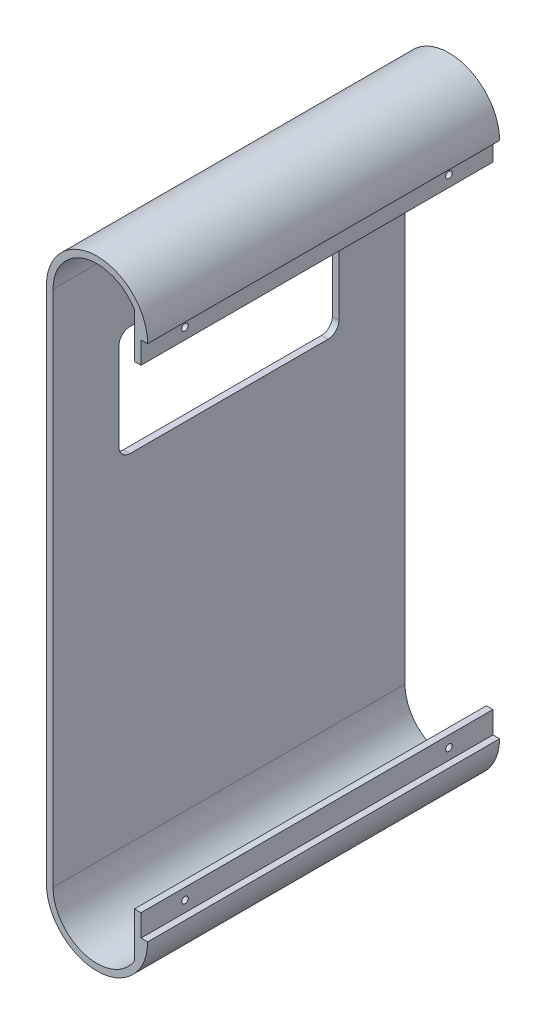
ISO-10303-21;
HEADER;
FILE_DESCRIPTION(('STEP AP214'),'2;1');
FILE_NAME('part.step','',(''),(''),'','','');
FILE_SCHEMA(('AUTOMOTIVE_DESIGN { 1 0 10303 214 1 1 1 1 }'));
ENDSEC;
DATA;
#1=APPLICATION_CONTEXT('core data for automotive mechanical design processes');
#2=APPLICATION_PROTOCOL_DEFINITION('international standard','automotive_design',2000,#1);
#3=PRODUCT_CONTEXT('',#1,'mechanical');
#4=PRODUCT('Part','Part','',(#3));
#5=PRODUCT_RELATED_PRODUCT_CATEGORY('part','',(#4));
#6=PRODUCT_DEFINITION_FORMATION('','',#4);
#7=PRODUCT_DEFINITION_CONTEXT('part definition',#1,'design');
#8=PRODUCT_DEFINITION('design','',#6,#7);
#9=PRODUCT_DEFINITION_SHAPE('','',#8);
#10=(LENGTH_UNIT() NAMED_UNIT(*) SI_UNIT(.MILLI.,.METRE.));
#11=(NAMED_UNIT(*) PLANE_ANGLE_UNIT() SI_UNIT($,.RADIAN.));
#12=(NAMED_UNIT(*) SI_UNIT($,.STERADIAN.) SOLID_ANGLE_UNIT());
#13=UNCERTAINTY_MEASURE_WITH_UNIT(LENGTH_MEASURE(1.E-05),#10,'distance_accuracy_value','');
#14=(GEOMETRIC_REPRESENTATION_CONTEXT(3) GLOBAL_UNCERTAINTY_ASSIGNED_CONTEXT((#13)) GLOBAL_UNIT_ASSIGNED_CONTEXT((#10,
#11,#12)) REPRESENTATION_CONTEXT('',''));
#15=CARTESIAN_POINT('',(0.,0.,0.));
#16=DIRECTION('',(0.,0.,1.));
#17=DIRECTION('',(1.,0.,0.));
#18=AXIS2_PLACEMENT_3D('',#15,#16,#17);
#19=CARTESIAN_POINT('',(4.,60.2499999999995,-160.000000000005));
#20=DIRECTION('',(0.,0.,-1.));
#21=DIRECTION('',(0.,-1.,0.));
#22=AXIS2_PLACEMENT_3D('',#19,#20,#21);
#23=PLANE('',#22);
#24=DIRECTION('',(1.,0.,0.));
#25=VECTOR('',#24,1.);
#26=CARTESIAN_POINT('',(0.,160.5,-160.000000000007));
#27=LINE('',#26,#25);
#28=CARTESIAN_POINT('',(0.,160.5,-160.000000000007));
#29=VERTEX_POINT('',#28);
#30=CARTESIAN_POINT('',(3.,160.5,-160.000000000007));
#31=VERTEX_POINT('',#30);
#32=EDGE_CURVE('E344',#29,#31,#27,.T.);
#33=ORIENTED_EDGE('',*,*,#32,.F.);
#34=DIRECTION('',(0.,-1.,0.));
#35=VECTOR('',#34,1.);
#36=CARTESIAN_POINT('',(-1.91556839834739E-12,150.500000000001,-160.000000000007));
#37=LINE('',#36,#35);
#38=CARTESIAN_POINT('',(-1.91556839834739E-12,150.500000000001,-160.000000000007));
#39=VERTEX_POINT('',#38);
#40=EDGE_CURVE('E261',#29,#39,#37,.T.);
#41=ORIENTED_EDGE('',*,*,#40,.T.);
#42=DIRECTION('',(-1.,0.,0.));
#43=VECTOR('',#42,1.);
#44=CARTESIAN_POINT('',(-3.00000000000191,150.500000000001,-160.000000000007));
#45=LINE('',#44,#43);
#46=CARTESIAN_POINT('',(-3.00000000000191,150.500000000001,-160.000000000007));
#47=VERTEX_POINT('',#46);
#48=EDGE_CURVE('E260',#39,#47,#45,.T.);
#49=ORIENTED_EDGE('',*,*,#48,.T.);
#50=DIRECTION('',(0.,1.,0.));
#51=VECTOR('',#50,1.);
#52=CARTESIAN_POINT('',(-3.00000000000191,150.500000000001,-160.000000000007));
#53=LINE('',#52,#51);
#54=CARTESIAN_POINT('',(-3.00000000000229,171.035653752857,-160.000000000007));
#55=VERTEX_POINT('',#54);
#56=EDGE_CURVE('E264',#47,#55,#53,.T.);
#57=ORIENTED_EDGE('',*,*,#56,.T.);
#58=CARTESIAN_POINT('',(-20.,160.5,-160.000000000007));
#59=DIRECTION('',(0.,0.,-1.));
#60=DIRECTION('',(0.,1.,0.));
#61=AXIS2_PLACEMENT_3D('',#58,#59,#60);
#62=CIRCLE('',#61,20.);
#63=CARTESIAN_POINT('',(-40.,160.5,-160.000000000005));
#64=VERTEX_POINT('',#63);
#65=EDGE_CURVE('E348',#64,#55,#62,.T.);
#66=ORIENTED_EDGE('',*,*,#65,.F.);
#67=DIRECTION('',(0.,1.,0.));
#68=VECTOR('',#67,1.);
#69=CARTESIAN_POINT('',(-40.,-74.9999999999967,-160.000000000004));
#70=LINE('',#69,#68);
#71=CARTESIAN_POINT('',(-40.,-75.,-160.000000000004));
#72=VERTEX_POINT('',#71);
#73=EDGE_CURVE('E306',#72,#64,#70,.T.);
#74=ORIENTED_EDGE('',*,*,#73,.F.);
#75=CARTESIAN_POINT('',(-20.,-75.,-160.000000000004));
#76=DIRECTION('',(0.,0.,-1.));
#77=DIRECTION('',(0.,1.,0.));
#78=AXIS2_PLACEMENT_3D('',#75,#76,#77);
#79=CIRCLE('',#78,20.);
#80=CARTESIAN_POINT('',(-3.,-85.5356537528528,-160.000000000004));
#81=VERTEX_POINT('',#80);
#82=EDGE_CURVE('E327',#81,#72,#79,.T.);
#83=ORIENTED_EDGE('',*,*,#82,.F.);
#84=DIRECTION('',(0.,1.,0.));
#85=VECTOR('',#84,1.);
#86=CARTESIAN_POINT('',(-3.,-65.,-160.000000000004));
#87=LINE('',#86,#85);
#88=CARTESIAN_POINT('',(-3.,-65.,-160.000000000004));
#89=VERTEX_POINT('',#88);
#90=EDGE_CURVE('E281',#81,#89,#87,.T.);
#91=ORIENTED_EDGE('',*,*,#90,.T.);
#92=DIRECTION('',(1.,0.,0.));
#93=VECTOR('',#92,1.);
#94=CARTESIAN_POINT('',(-3.,-65.,-160.000000000004));
#95=LINE('',#94,#93);
#96=CARTESIAN_POINT('',(0.,-65.,-160.000000000004));
#97=VERTEX_POINT('',#96);
#98=EDGE_CURVE('E286',#89,#97,#95,.T.);
#99=ORIENTED_EDGE('',*,*,#98,.T.);
#100=DIRECTION('',(0.,-1.,0.));
#101=VECTOR('',#100,1.);
#102=CARTESIAN_POINT('',(0.,-65.,-160.000000000004));
#103=LINE('',#102,#101);
#104=CARTESIAN_POINT('',(0.,-75.,-160.000000000004));
#105=VERTEX_POINT('',#104);
#106=EDGE_CURVE('E282',#97,#105,#103,.T.);
#107=ORIENTED_EDGE('',*,*,#106,.T.);
#108=DIRECTION('',(-1.,0.,0.));
#109=VECTOR('',#108,1.);
#110=CARTESIAN_POINT('',(0.,-75.,-160.000000000004));
#111=LINE('',#110,#109);
#112=CARTESIAN_POINT('',(3.,-75.,-160.000000000004));
#113=VERTEX_POINT('',#112);
#114=EDGE_CURVE('E331',#113,#105,#111,.T.);
#115=ORIENTED_EDGE('',*,*,#114,.F.);
#116=CARTESIAN_POINT('',(-20.,-75.,-160.000000000004));
#117=DIRECTION('',(0.,0.,-1.));
#118=DIRECTION('',(0.,1.,0.));
#119=AXIS2_PLACEMENT_3D('',#116,#117,#118);
#120=CIRCLE('',#119,23.);
#121=CARTESIAN_POINT('',(-43.,-75.,-160.000000000004));
#122=VERTEX_POINT('',#121);
#123=EDGE_CURVE('E334',#122,#113,#120,.F.);
#124=ORIENTED_EDGE('',*,*,#123,.F.);
#125=DIRECTION('',(0.,-1.,0.));
#126=VECTOR('',#125,1.);
#127=CARTESIAN_POINT('',(-43.,-74.9999999999967,-160.000000000004));
#128=LINE('',#127,#126);
#129=CARTESIAN_POINT('',(-43.,160.5,-160.000000000007));
#130=VERTEX_POINT('',#129);
#131=EDGE_CURVE('E337',#130,#122,#128,.T.);
#132=ORIENTED_EDGE('',*,*,#131,.F.);
#133=CARTESIAN_POINT('',(-20.,160.5,-160.000000000007));
#134=DIRECTION('',(0.,0.,-1.));
#135=DIRECTION('',(0.,1.,0.));
#136=AXIS2_PLACEMENT_3D('',#133,#134,#135);
#137=CIRCLE('',#136,23.);
#138=EDGE_CURVE('E341',#31,#130,#137,.F.);
#139=ORIENTED_EDGE('',*,*,#138,.F.);
#140=EDGE_LOOP('',(#33,#41,#49,#57,#66,#74,#83,#91,#99,#107,#115,#124,#132,#139));
#141=FACE_BOUND('',#140,.T.);
#142=ADVANCED_FACE('F34',(#141),#23,.T.);
#143=CARTESIAN_POINT('',(-20.,-75.,0.));
#144=DIRECTION('',(0.,0.,1.));
#145=DIRECTION('',(1.,0.,0.));
#146=AXIS2_PLACEMENT_3D('',#143,#144,#145);
#147=PLANE('',#146);
#148=CARTESIAN_POINT('',(-20.,160.5,0.));
#149=DIRECTION('',(0.,0.,-1.));
#150=DIRECTION('',(-1.,0.,0.));
#151=AXIS2_PLACEMENT_3D('',#148,#149,#150);
#152=CIRCLE('',#151,20.);
#153=CARTESIAN_POINT('',(-40.,160.5,0.));
#154=VERTEX_POINT('',#153);
#155=CARTESIAN_POINT('',(-3.00000000000229,171.035653752857,0.));
#156=VERTEX_POINT('',#155);
#157=EDGE_CURVE('E317',#154,#156,#152,.T.);
#158=ORIENTED_EDGE('',*,*,#157,.T.);
#159=DIRECTION('',(0.,1.,0.));
#160=VECTOR('',#159,1.);
#161=CARTESIAN_POINT('',(-3.00000000000191,150.500000000003,0.));
#162=LINE('',#161,#160);
#163=CARTESIAN_POINT('',(-3.00000000000191,150.500000000001,0.));
#164=VERTEX_POINT('',#163);
#165=EDGE_CURVE('E263',#164,#156,#162,.T.);
#166=ORIENTED_EDGE('',*,*,#165,.F.);
#167=DIRECTION('',(-1.,0.,0.));
#168=VECTOR('',#167,1.);
#169=CARTESIAN_POINT('',(-3.00000000000191,150.500000000003,0.));
#170=LINE('',#169,#168);
#171=CARTESIAN_POINT('',(-1.91556839834736E-12,150.500000000001,0.));
#172=VERTEX_POINT('',#171);
#173=EDGE_CURVE('E272',#172,#164,#170,.T.);
#174=ORIENTED_EDGE('',*,*,#173,.F.);
#175=DIRECTION('',(0.,-1.,0.));
#176=VECTOR('',#175,1.);
#177=CARTESIAN_POINT('',(-1.91556839834739E-12,150.500000000003,0.));
#178=LINE('',#177,#176);
#179=CARTESIAN_POINT('',(-2.09730250691962E-12,160.5,0.));
#180=VERTEX_POINT('',#179);
#181=EDGE_CURVE('E271',#180,#172,#178,.T.);
#182=ORIENTED_EDGE('',*,*,#181,.F.);
#183=DIRECTION('',(1.,0.,0.));
#184=VECTOR('',#183,1.);
#185=CARTESIAN_POINT('',(0.,160.5,0.));
#186=LINE('',#185,#184);
#187=CARTESIAN_POINT('',(3.,160.5,0.));
#188=VERTEX_POINT('',#187);
#189=EDGE_CURVE('E314',#180,#188,#186,.T.);
#190=ORIENTED_EDGE('',*,*,#189,.T.);
#191=CARTESIAN_POINT('',(-20.,160.5,0.));
#192=DIRECTION('',(0.,0.,1.));
#193=DIRECTION('',(-1.,0.,0.));
#194=AXIS2_PLACEMENT_3D('',#191,#192,#193);
#195=CIRCLE('',#194,23.);
#196=CARTESIAN_POINT('',(-43.,160.5,0.));
#197=VERTEX_POINT('',#196);
#198=EDGE_CURVE('E312',#188,#197,#195,.T.);
#199=ORIENTED_EDGE('',*,*,#198,.T.);
#200=DIRECTION('',(0.,-1.,0.));
#201=VECTOR('',#200,1.);
#202=CARTESIAN_POINT('',(-43.,-75.,0.));
#203=LINE('',#202,#201);
#204=CARTESIAN_POINT('',(-43.,-75.,0.));
#205=VERTEX_POINT('',#204);
#206=EDGE_CURVE('E309',#197,#205,#203,.T.);
#207=ORIENTED_EDGE('',*,*,#206,.T.);
#208=CARTESIAN_POINT('',(-20.,-75.,0.));
#209=DIRECTION('',(0.,0.,1.));
#210=DIRECTION('',(1.,0.,0.));
#211=AXIS2_PLACEMENT_3D('',#208,#209,#210);
#212=CIRCLE('',#211,23.);
#213=CARTESIAN_POINT('',(3.,-75.,0.));
#214=VERTEX_POINT('',#213);
#215=EDGE_CURVE('E307',#205,#214,#212,.T.);
#216=ORIENTED_EDGE('',*,*,#215,.T.);
#217=DIRECTION('',(-1.,0.,0.));
#218=VECTOR('',#217,1.);
#219=CARTESIAN_POINT('',(0.,-75.,0.));
#220=LINE('',#219,#218);
#221=CARTESIAN_POINT('',(0.,-75.,0.));
#222=VERTEX_POINT('',#221);
#223=EDGE_CURVE('E303',#214,#222,#220,.T.);
#224=ORIENTED_EDGE('',*,*,#223,.T.);
#225=DIRECTION('',(0.,-1.,0.));
#226=VECTOR('',#225,1.);
#227=CARTESIAN_POINT('',(0.,-64.9999999999979,0.));
#228=LINE('',#227,#226);
#229=CARTESIAN_POINT('',(0.,-64.9999999999982,0.));
#230=VERTEX_POINT('',#229);
#231=EDGE_CURVE('E296',#230,#222,#228,.T.);
#232=ORIENTED_EDGE('',*,*,#231,.F.);
#233=DIRECTION('',(1.,0.,0.));
#234=VECTOR('',#233,1.);
#235=CARTESIAN_POINT('',(-3.,-64.9999999999982,0.));
#236=LINE('',#235,#234);
#237=CARTESIAN_POINT('',(-3.,-64.9999999999982,0.));
#238=VERTEX_POINT('',#237);
#239=EDGE_CURVE('E285',#238,#230,#236,.T.);
#240=ORIENTED_EDGE('',*,*,#239,.F.);
#241=DIRECTION('',(0.,1.,0.));
#242=VECTOR('',#241,1.);
#243=CARTESIAN_POINT('',(-3.,-64.9999999999979,0.));
#244=LINE('',#243,#242);
#245=CARTESIAN_POINT('',(-3.,-85.5356537528528,0.));
#246=VERTEX_POINT('',#245);
#247=EDGE_CURVE('E293',#246,#238,#244,.T.);
#248=ORIENTED_EDGE('',*,*,#247,.F.);
#249=CARTESIAN_POINT('',(-20.,-75.,0.));
#250=DIRECTION('',(0.,0.,-1.));
#251=DIRECTION('',(1.,0.,0.));
#252=AXIS2_PLACEMENT_3D('',#249,#250,#251);
#253=CIRCLE('',#252,20.);
#254=CARTESIAN_POINT('',(-40.,-75.,0.));
#255=VERTEX_POINT('',#254);
#256=EDGE_CURVE('E302',#246,#255,#253,.T.);
#257=ORIENTED_EDGE('',*,*,#256,.T.);
#258=DIRECTION('',(0.,1.,0.));
#259=VECTOR('',#258,1.);
#260=CARTESIAN_POINT('',(-40.,-75.,0.));
#261=LINE('',#260,#259);
#262=EDGE_CURVE('E320',#255,#154,#261,.T.);
#263=ORIENTED_EDGE('',*,*,#262,.T.);
#264=EDGE_LOOP('',(#158,#166,#174,#182,#190,#199,#207,#216,#224,#232,#240,#248,#257,#263));
#265=FACE_BOUND('',#264,.T.);
#266=ADVANCED_FACE('F391',(#265),#147,.T.);
#267=CARTESIAN_POINT('',(-40.,-75.,-445.233676132401));
#268=DIRECTION('',(1.,0.,0.));
#269=DIRECTION('',(0.,0.,-1.));
#270=AXIS2_PLACEMENT_3D('',#267,#268,#269);
#271=PLANE('',#270);
#272=DIRECTION('',(0.,-1.,0.));
#273=VECTOR('',#272,1.);
#274=CARTESIAN_POINT('',(-40.,123.257283518407,-130.00000000001));
#275=LINE('',#274,#273);
#276=CARTESIAN_POINT('',(-40.,123.257283518407,-130.00000000001));
#277=VERTEX_POINT('',#276);
#278=CARTESIAN_POINT('',(-40.,83.2572835184067,-130.00000000001));
#279=VERTEX_POINT('',#278);
#280=EDGE_CURVE('E198',#277,#279,#275,.T.);
#281=ORIENTED_EDGE('',*,*,#280,.T.);
#282=CARTESIAN_POINT('',(-40.,83.2572835184067,-125.00000000001));
#283=DIRECTION('',(1.,0.,0.));
#284=DIRECTION('',(0.,0.,-1.));
#285=AXIS2_PLACEMENT_3D('',#282,#283,#284);
#286=CIRCLE('',#285,5.);
#287=CARTESIAN_POINT('',(-40.,78.2572835184067,-125.00000000001));
#288=VERTEX_POINT('',#287);
#289=EDGE_CURVE('E185',#279,#288,#286,.F.);
#290=ORIENTED_EDGE('',*,*,#289,.T.);
#291=DIRECTION('',(0.,0.,1.));
#292=VECTOR('',#291,1.);
#293=CARTESIAN_POINT('',(-40.,78.2572835184067,-125.00000000001));
#294=LINE('',#293,#292);
#295=CARTESIAN_POINT('',(-40.,78.2572835184067,-35.0000000000102));
#296=VERTEX_POINT('',#295);
#297=EDGE_CURVE('E232',#288,#296,#294,.T.);
#298=ORIENTED_EDGE('',*,*,#297,.T.);
#299=CARTESIAN_POINT('',(-40.,83.2572835184067,-35.0000000000102));
#300=DIRECTION('',(1.,0.,0.));
#301=DIRECTION('',(0.,0.,-1.));
#302=AXIS2_PLACEMENT_3D('',#299,#300,#301);
#303=CIRCLE('',#302,5.);
#304=CARTESIAN_POINT('',(-40.,83.2572835184067,-30.0000000000102));
#305=VERTEX_POINT('',#304);
#306=EDGE_CURVE('E228',#296,#305,#303,.F.);
#307=ORIENTED_EDGE('',*,*,#306,.T.);
#308=DIRECTION('',(0.,1.,0.));
#309=VECTOR('',#308,1.);
#310=CARTESIAN_POINT('',(-40.,123.257283518407,-30.0000000000102));
#311=LINE('',#310,#309);
#312=CARTESIAN_POINT('',(-40.,123.257283518407,-30.0000000000102));
#313=VERTEX_POINT('',#312);
#314=EDGE_CURVE('E224',#305,#313,#311,.T.);
#315=ORIENTED_EDGE('',*,*,#314,.T.);
#316=CARTESIAN_POINT('',(-40.,123.257283518407,-35.0000000000102));
#317=DIRECTION('',(1.,0.,0.));
#318=DIRECTION('',(0.,0.,-1.));
#319=AXIS2_PLACEMENT_3D('',#316,#317,#318);
#320=CIRCLE('',#319,5.);
#321=CARTESIAN_POINT('',(-40.,128.257283518407,-35.0000000000102));
#322=VERTEX_POINT('',#321);
#323=EDGE_CURVE('E220',#313,#322,#320,.F.);
#324=ORIENTED_EDGE('',*,*,#323,.T.);
#325=DIRECTION('',(0.,0.,-1.));
#326=VECTOR('',#325,1.);
#327=CARTESIAN_POINT('',(-40.,128.257283518407,-125.00000000001));
#328=LINE('',#327,#326);
#329=CARTESIAN_POINT('',(-40.,128.257283518407,-125.00000000001));
#330=VERTEX_POINT('',#329);
#331=EDGE_CURVE('E217',#322,#330,#328,.T.);
#332=ORIENTED_EDGE('',*,*,#331,.T.);
#333=CARTESIAN_POINT('',(-40.,123.257283518407,-125.00000000001));
#334=DIRECTION('',(1.,0.,0.));
#335=DIRECTION('',(0.,0.,-1.));
#336=AXIS2_PLACEMENT_3D('',#333,#334,#335);
#337=CIRCLE('',#336,5.);
#338=EDGE_CURVE('E207',#330,#277,#337,.F.);
#339=ORIENTED_EDGE('',*,*,#338,.T.);
#340=EDGE_LOOP('',(#281,#290,#298,#307,#315,#324,#332,#339));
#341=FACE_BOUND('',#340,.T.);
#342=DIRECTION('',(0.,0.,1.));
#343=VECTOR('',#342,1.);
#344=CARTESIAN_POINT('',(-40.,-75.,-445.233676132401));
#345=LINE('',#344,#343);
#346=EDGE_CURVE('E329',#72,#255,#345,.T.);
#347=ORIENTED_EDGE('',*,*,#346,.F.);
#348=ORIENTED_EDGE('',*,*,#73,.T.);
#349=DIRECTION('',(0.,0.,1.));
#350=VECTOR('',#349,1.);
#351=CARTESIAN_POINT('',(-40.,160.5,-445.233676132401));
#352=LINE('',#351,#350);
#353=EDGE_CURVE('E326',#64,#154,#352,.T.);
#354=ORIENTED_EDGE('',*,*,#353,.T.);
#355=ORIENTED_EDGE('',*,*,#262,.F.);
#356=EDGE_LOOP('',(#347,#348,#354,#355));
#357=FACE_BOUND('',#356,.T.);
#358=ADVANCED_FACE('F204',(#341,#357),#271,.T.);
#359=CARTESIAN_POINT('',(-20.,160.5,-445.233676132401));
#360=DIRECTION('',(0.,0.,1.));
#361=DIRECTION('',(1.,0.,0.));
#362=AXIS2_PLACEMENT_3D('',#359,#360,#361);
#363=CYLINDRICAL_SURFACE('',#362,20.);
#364=DIRECTION('',(0.,0.,1.));
#365=VECTOR('',#364,1.);
#366=CARTESIAN_POINT('',(-3.00000000000229,171.035653752857,-445.233676132401));
#367=LINE('',#366,#365);
#368=EDGE_CURVE('E11',#156,#55,#367,.F.);
#369=ORIENTED_EDGE('',*,*,#368,.F.);
#370=ORIENTED_EDGE('',*,*,#157,.F.);
#371=ORIENTED_EDGE('',*,*,#353,.F.);
#372=ORIENTED_EDGE('',*,*,#65,.T.);
#373=EDGE_LOOP('',(#369,#370,#371,#372));
#374=FACE_BOUND('',#373,.T.);
#375=ADVANCED_FACE('F403',(#374),#363,.F.);
#376=CARTESIAN_POINT('',(0.,160.5,-445.233676132401));
#377=DIRECTION('',(0.,-1.,0.));
#378=DIRECTION('',(0.,0.,-1.));
#379=AXIS2_PLACEMENT_3D('',#376,#377,#378);
#380=PLANE('',#379);
#381=DIRECTION('',(0.,0.,1.));
#382=VECTOR('',#381,1.);
#383=CARTESIAN_POINT('',(0.,160.5,-445.233676132401));
#384=LINE('',#383,#382);
#385=EDGE_CURVE('E347',#29,#180,#384,.T.);
#386=ORIENTED_EDGE('',*,*,#385,.F.);
#387=ORIENTED_EDGE('',*,*,#32,.T.);
#388=DIRECTION('',(0.,0.,1.));
#389=VECTOR('',#388,1.);
#390=CARTESIAN_POINT('',(3.,160.5,-445.233676132401));
#391=LINE('',#390,#389);
#392=EDGE_CURVE('E343',#31,#188,#391,.T.);
#393=ORIENTED_EDGE('',*,*,#392,.T.);
#394=ORIENTED_EDGE('',*,*,#189,.F.);
#395=EDGE_LOOP('',(#386,#387,#393,#394));
#396=FACE_BOUND('',#395,.T.);
#397=ADVANCED_FACE('F388',(#396),#380,.T.);
#398=CARTESIAN_POINT('',(-20.,160.5,-445.233676132401));
#399=DIRECTION('',(0.,0.,1.));
#400=DIRECTION('',(1.,0.,0.));
#401=AXIS2_PLACEMENT_3D('',#398,#399,#400);
#402=CYLINDRICAL_SURFACE('',#401,23.);
#403=ORIENTED_EDGE('',*,*,#138,.T.);
#404=DIRECTION('',(0.,0.,1.));
#405=VECTOR('',#404,1.);
#406=CARTESIAN_POINT('',(-43.,160.5,-445.233676132401));
#407=LINE('',#406,#405);
#408=EDGE_CURVE('E340',#130,#197,#407,.T.);
#409=ORIENTED_EDGE('',*,*,#408,.T.);
#410=ORIENTED_EDGE('',*,*,#198,.F.);
#411=ORIENTED_EDGE('',*,*,#392,.F.);
#412=EDGE_LOOP('',(#403,#409,#410,#411));
#413=FACE_BOUND('',#412,.T.);
#414=ADVANCED_FACE('F435',(#413),#402,.T.);
#415=CARTESIAN_POINT('',(-43.,-75.,-445.233676132401));
#416=DIRECTION('',(-1.,0.,0.));
#417=DIRECTION('',(0.,-1.,0.));
#418=AXIS2_PLACEMENT_3D('',#415,#416,#417);
#419=PLANE('',#418);
#420=DIRECTION('',(0.,-1.,0.));
#421=VECTOR('',#420,1.);
#422=CARTESIAN_POINT('',(-43.,123.257283518407,-130.00000000001));
#423=LINE('',#422,#421);
#424=CARTESIAN_POINT('',(-43.,123.257283518407,-130.00000000001));
#425=VERTEX_POINT('',#424);
#426=CARTESIAN_POINT('',(-43.,83.2572835184067,-130.00000000001));
#427=VERTEX_POINT('',#426);
#428=EDGE_CURVE('E201',#425,#427,#423,.T.);
#429=ORIENTED_EDGE('',*,*,#428,.F.);
#430=CARTESIAN_POINT('',(-43.,123.257283518407,-125.00000000001));
#431=DIRECTION('',(-1.,0.,0.));
#432=DIRECTION('',(0.,-1.,0.));
#433=AXIS2_PLACEMENT_3D('',#430,#431,#432);
#434=CIRCLE('',#433,5.);
#435=CARTESIAN_POINT('',(-43.,128.257283518407,-125.00000000001));
#436=VERTEX_POINT('',#435);
#437=EDGE_CURVE('E213',#436,#425,#434,.T.);
#438=ORIENTED_EDGE('',*,*,#437,.F.);
#439=DIRECTION('',(0.,0.,-1.));
#440=VECTOR('',#439,1.);
#441=CARTESIAN_POINT('',(-43.,128.257283518407,-125.00000000001));
#442=LINE('',#441,#440);
#443=CARTESIAN_POINT('',(-43.,128.257283518407,-35.0000000000102));
#444=VERTEX_POINT('',#443);
#445=EDGE_CURVE('E58',#444,#436,#442,.T.);
#446=ORIENTED_EDGE('',*,*,#445,.F.);
#447=CARTESIAN_POINT('',(-43.,123.257283518407,-35.0000000000102));
#448=DIRECTION('',(-1.,0.,0.));
#449=DIRECTION('',(0.,1.,0.));
#450=AXIS2_PLACEMENT_3D('',#447,#448,#449);
#451=CIRCLE('',#450,5.);
#452=CARTESIAN_POINT('',(-43.,123.257283518407,-30.0000000000102));
#453=VERTEX_POINT('',#452);
#454=EDGE_CURVE('E209',#453,#444,#451,.T.);
#455=ORIENTED_EDGE('',*,*,#454,.F.);
#456=DIRECTION('',(0.,1.,0.));
#457=VECTOR('',#456,1.);
#458=CARTESIAN_POINT('',(-43.,123.257283518407,-30.0000000000102));
#459=LINE('',#458,#457);
#460=CARTESIAN_POINT('',(-43.,83.2572835184067,-30.0000000000102));
#461=VERTEX_POINT('',#460);
#462=EDGE_CURVE('E698',#461,#453,#459,.T.);
#463=ORIENTED_EDGE('',*,*,#462,.F.);
#464=CARTESIAN_POINT('',(-43.,83.2572835184067,-35.0000000000102));
#465=DIRECTION('',(-1.,0.,0.));
#466=DIRECTION('',(0.,-1.,0.));
#467=AXIS2_PLACEMENT_3D('',#464,#465,#466);
#468=CIRCLE('',#467,5.);
#469=CARTESIAN_POINT('',(-43.,78.2572835184067,-35.0000000000102));
#470=VERTEX_POINT('',#469);
#471=EDGE_CURVE('E695',#470,#461,#468,.T.);
#472=ORIENTED_EDGE('',*,*,#471,.F.);
#473=DIRECTION('',(0.,0.,1.));
#474=VECTOR('',#473,1.);
#475=CARTESIAN_POINT('',(-43.,78.2572835184067,-125.00000000001));
#476=LINE('',#475,#474);
#477=CARTESIAN_POINT('',(-43.,78.2572835184067,-125.00000000001));
#478=VERTEX_POINT('',#477);
#479=EDGE_CURVE('E690',#478,#470,#476,.T.);
#480=ORIENTED_EDGE('',*,*,#479,.F.);
#481=CARTESIAN_POINT('',(-43.,83.2572835184067,-125.00000000001));
#482=DIRECTION('',(-1.,0.,0.));
#483=DIRECTION('',(0.,-1.,0.));
#484=AXIS2_PLACEMENT_3D('',#481,#482,#483);
#485=CIRCLE('',#484,5.);
#486=EDGE_CURVE('E689',#427,#478,#485,.T.);
#487=ORIENTED_EDGE('',*,*,#486,.F.);
#488=EDGE_LOOP('',(#429,#438,#446,#455,#463,#472,#480,#487));
#489=FACE_BOUND('',#488,.T.);
#490=ORIENTED_EDGE('',*,*,#408,.F.);
#491=ORIENTED_EDGE('',*,*,#131,.T.);
#492=DIRECTION('',(0.,0.,1.));
#493=VECTOR('',#492,1.);
#494=CARTESIAN_POINT('',(-43.,-75.,-445.233676132401));
#495=LINE('',#494,#493);
#496=EDGE_CURVE('E336',#122,#205,#495,.T.);
#497=ORIENTED_EDGE('',*,*,#496,.T.);
#498=ORIENTED_EDGE('',*,*,#206,.F.);
#499=EDGE_LOOP('',(#490,#491,#497,#498));
#500=FACE_BOUND('',#499,.T.);
#501=ADVANCED_FACE('F433',(#489,#500),#419,.T.);
#502=CARTESIAN_POINT('',(-20.,-75.,-445.233676132401));
#503=DIRECTION('',(0.,0.,1.));
#504=DIRECTION('',(1.,0.,0.));
#505=AXIS2_PLACEMENT_3D('',#502,#503,#504);
#506=CYLINDRICAL_SURFACE('',#505,23.);
#507=ORIENTED_EDGE('',*,*,#123,.T.);
#508=DIRECTION('',(0.,0.,1.));
#509=VECTOR('',#508,1.);
#510=CARTESIAN_POINT('',(3.,-75.,-445.233676132401));
#511=LINE('',#510,#509);
#512=EDGE_CURVE('E333',#113,#214,#511,.T.);
#513=ORIENTED_EDGE('',*,*,#512,.T.);
#514=ORIENTED_EDGE('',*,*,#215,.F.);
#515=ORIENTED_EDGE('',*,*,#496,.F.);
#516=EDGE_LOOP('',(#507,#513,#514,#515));
#517=FACE_BOUND('',#516,.T.);
#518=ADVANCED_FACE('F430',(#517),#506,.T.);
#519=CARTESIAN_POINT('',(0.,-75.,-445.233676132401));
#520=DIRECTION('',(0.,1.,0.));
#521=DIRECTION('',(0.,0.,1.));
#522=AXIS2_PLACEMENT_3D('',#519,#520,#521);
#523=PLANE('',#522);
#524=ORIENTED_EDGE('',*,*,#512,.F.);
#525=ORIENTED_EDGE('',*,*,#114,.T.);
#526=DIRECTION('',(0.,0.,1.));
#527=VECTOR('',#526,1.);
#528=CARTESIAN_POINT('',(0.,-75.,-445.233676132401));
#529=LINE('',#528,#527);
#530=EDGE_CURVE('E330',#105,#222,#529,.T.);
#531=ORIENTED_EDGE('',*,*,#530,.T.);
#532=ORIENTED_EDGE('',*,*,#223,.F.);
#533=EDGE_LOOP('',(#524,#525,#531,#532));
#534=FACE_BOUND('',#533,.T.);
#535=ADVANCED_FACE('F425',(#534),#523,.T.);
#536=CARTESIAN_POINT('',(-20.,-75.,-445.233676132401));
#537=DIRECTION('',(0.,0.,1.));
#538=DIRECTION('',(1.,0.,0.));
#539=AXIS2_PLACEMENT_3D('',#536,#537,#538);
#540=CYLINDRICAL_SURFACE('',#539,20.);
#541=DIRECTION('',(0.,0.,1.));
#542=VECTOR('',#541,1.);
#543=CARTESIAN_POINT('',(-3.,-85.5356537528528,-445.233676132401));
#544=LINE('',#543,#542);
#545=EDGE_CURVE('E42',#81,#246,#544,.T.);
#546=ORIENTED_EDGE('',*,*,#545,.F.);
#547=ORIENTED_EDGE('',*,*,#82,.T.);
#548=ORIENTED_EDGE('',*,*,#346,.T.);
#549=ORIENTED_EDGE('',*,*,#256,.F.);
#550=EDGE_LOOP('',(#546,#547,#548,#549));
#551=FACE_BOUND('',#550,.T.);
#552=ADVANCED_FACE('F406',(#551),#540,.F.);
#553=CARTESIAN_POINT('',(0.,-64.9999999999979,21.5674832521582));
#554=DIRECTION('',(1.,0.,0.));
#555=DIRECTION('',(0.,1.,0.));
#556=AXIS2_PLACEMENT_3D('',#553,#554,#555);
#557=PLANE('',#556);
#558=CARTESIAN_POINT('',(0.,-69.9999999999982,-20.));
#559=DIRECTION('',(1.,0.,0.));
#560=DIRECTION('',(0.,1.,0.));
#561=AXIS2_PLACEMENT_3D('',#558,#559,#560);
#562=CIRCLE('',#561,1.5);
#563=CARTESIAN_POINT('',(0.,-68.4999999999982,-20.));
#564=VERTEX_POINT('',#563);
#565=EDGE_CURVE('E257',#564,#564,#562,.T.);
#566=ORIENTED_EDGE('',*,*,#565,.F.);
#567=EDGE_LOOP('',(#566));
#568=FACE_BOUND('',#567,.T.);
#569=CARTESIAN_POINT('',(0.,-69.9999999999982,-140.000000000007));
#570=DIRECTION('',(1.,0.,0.));
#571=DIRECTION('',(0.,1.,0.));
#572=AXIS2_PLACEMENT_3D('',#569,#570,#571);
#573=CIRCLE('',#572,1.5);
#574=CARTESIAN_POINT('',(0.,-68.4999999999982,-140.000000000007));
#575=VERTEX_POINT('',#574);
#576=EDGE_CURVE('E254',#575,#575,#573,.T.);
#577=ORIENTED_EDGE('',*,*,#576,.F.);
#578=EDGE_LOOP('',(#577));
#579=FACE_BOUND('',#578,.T.);
#580=ORIENTED_EDGE('',*,*,#530,.F.);
#581=ORIENTED_EDGE('',*,*,#106,.F.);
#582=DIRECTION('',(0.,0.,-1.));
#583=VECTOR('',#582,1.);
#584=CARTESIAN_POINT('',(0.,-64.9999999999979,21.5674832521582));
#585=LINE('',#584,#583);
#586=EDGE_CURVE('E292',#230,#97,#585,.T.);
#587=ORIENTED_EDGE('',*,*,#586,.F.);
#588=ORIENTED_EDGE('',*,*,#231,.T.);
#589=EDGE_LOOP('',(#580,#581,#587,#588));
#590=FACE_BOUND('',#589,.T.);
#591=ADVANCED_FACE('F422',(#568,#579,#590),#557,.T.);
#592=CARTESIAN_POINT('',(-3.,-64.9999999999979,21.5674832521582));
#593=DIRECTION('',(0.,1.,0.));
#594=DIRECTION('',(0.,0.,1.));
#595=AXIS2_PLACEMENT_3D('',#592,#593,#594);
#596=PLANE('',#595);
#597=DIRECTION('',(0.,0.,-1.));
#598=VECTOR('',#597,1.);
#599=CARTESIAN_POINT('',(-3.,-64.9999999999979,21.5674832521582));
#600=LINE('',#599,#598);
#601=EDGE_CURVE('E295',#238,#89,#600,.T.);
#602=ORIENTED_EDGE('',*,*,#601,.F.);
#603=ORIENTED_EDGE('',*,*,#239,.T.);
#604=ORIENTED_EDGE('',*,*,#586,.T.);
#605=ORIENTED_EDGE('',*,*,#98,.F.);
#606=EDGE_LOOP('',(#602,#603,#604,#605));
#607=FACE_BOUND('',#606,.T.);
#608=ADVANCED_FACE('F415',(#607),#596,.T.);
#609=CARTESIAN_POINT('',(-3.,-64.9999999999979,21.5674832521582));
#610=DIRECTION('',(-1.,0.,0.));
#611=DIRECTION('',(0.,-1.,0.));
#612=AXIS2_PLACEMENT_3D('',#609,#610,#611);
#613=PLANE('',#612);
#614=CARTESIAN_POINT('',(-3.,-69.9999999999982,-20.));
#615=DIRECTION('',(-1.,0.,0.));
#616=DIRECTION('',(0.,-1.,0.));
#617=AXIS2_PLACEMENT_3D('',#614,#615,#616);
#618=CIRCLE('',#617,1.5);
#619=CARTESIAN_POINT('',(-3.,-71.4999999999982,-20.));
#620=VERTEX_POINT('',#619);
#621=EDGE_CURVE('E242',#620,#620,#618,.T.);
#622=ORIENTED_EDGE('',*,*,#621,.F.);
#623=EDGE_LOOP('',(#622));
#624=FACE_BOUND('',#623,.T.);
#625=CARTESIAN_POINT('',(-3.,-69.9999999999982,-140.000000000007));
#626=DIRECTION('',(-1.,0.,0.));
#627=DIRECTION('',(0.,-1.,0.));
#628=AXIS2_PLACEMENT_3D('',#625,#626,#627);
#629=CIRCLE('',#628,1.5);
#630=CARTESIAN_POINT('',(-3.,-71.4999999999982,-140.000000000007));
#631=VERTEX_POINT('',#630);
#632=EDGE_CURVE('E245',#631,#631,#629,.T.);
#633=ORIENTED_EDGE('',*,*,#632,.F.);
#634=EDGE_LOOP('',(#633));
#635=FACE_BOUND('',#634,.T.);
#636=ORIENTED_EDGE('',*,*,#90,.F.);
#637=ORIENTED_EDGE('',*,*,#545,.T.);
#638=ORIENTED_EDGE('',*,*,#247,.T.);
#639=ORIENTED_EDGE('',*,*,#601,.T.);
#640=EDGE_LOOP('',(#636,#637,#638,#639));
#641=FACE_BOUND('',#640,.T.);
#642=ADVANCED_FACE('F409',(#624,#635,#641),#613,.T.);
#643=CARTESIAN_POINT('',(-3.00000000000191,150.500000000003,21.5674832521557));
#644=DIRECTION('',(-1.,0.,0.));
#645=DIRECTION('',(0.,-1.,0.));
#646=AXIS2_PLACEMENT_3D('',#643,#644,#645);
#647=PLANE('',#646);
#648=CARTESIAN_POINT('',(-2.99999999999997,155.499999999999,-140.000000000007));
#649=DIRECTION('',(-1.,0.,0.));
#650=DIRECTION('',(0.,1.,0.));
#651=AXIS2_PLACEMENT_3D('',#648,#649,#650);
#652=CIRCLE('',#651,1.5);
#653=CARTESIAN_POINT('',(-2.99999999999997,156.999999999999,-140.000000000007));
#654=VERTEX_POINT('',#653);
#655=EDGE_CURVE('E241',#654,#654,#652,.T.);
#656=ORIENTED_EDGE('',*,*,#655,.F.);
#657=EDGE_LOOP('',(#656));
#658=FACE_BOUND('',#657,.T.);
#659=CARTESIAN_POINT('',(-2.99999999999997,155.499999999999,-20.));
#660=DIRECTION('',(-1.,0.,0.));
#661=DIRECTION('',(0.,1.,0.));
#662=AXIS2_PLACEMENT_3D('',#659,#660,#661);
#663=CIRCLE('',#662,1.5);
#664=CARTESIAN_POINT('',(-2.99999999999997,156.999999999999,-20.));
#665=VERTEX_POINT('',#664);
#666=EDGE_CURVE('E246',#665,#665,#663,.T.);
#667=ORIENTED_EDGE('',*,*,#666,.F.);
#668=EDGE_LOOP('',(#667));
#669=FACE_BOUND('',#668,.T.);
#670=ORIENTED_EDGE('',*,*,#165,.T.);
#671=ORIENTED_EDGE('',*,*,#368,.T.);
#672=ORIENTED_EDGE('',*,*,#56,.F.);
#673=DIRECTION('',(0.,0.,-1.));
#674=VECTOR('',#673,1.);
#675=CARTESIAN_POINT('',(-3.00000000000191,150.500000000003,21.5674832521557));
#676=LINE('',#675,#674);
#677=EDGE_CURVE('E275',#164,#47,#676,.T.);
#678=ORIENTED_EDGE('',*,*,#677,.F.);
#679=EDGE_LOOP('',(#670,#671,#672,#678));
#680=FACE_BOUND('',#679,.T.);
#681=ADVANCED_FACE('F376',(#658,#669,#680),#647,.T.);
#682=CARTESIAN_POINT('',(-1.91556839834739E-12,150.500000000003,21.5674832521557));
#683=DIRECTION('',(1.,0.,0.));
#684=DIRECTION('',(0.,1.,0.));
#685=AXIS2_PLACEMENT_3D('',#682,#683,#684);
#686=PLANE('',#685);
#687=CARTESIAN_POINT('',(-2.00664138083617E-12,155.499999999999,-140.000000000007));
#688=DIRECTION('',(1.,0.,0.));
#689=DIRECTION('',(0.,1.,0.));
#690=AXIS2_PLACEMENT_3D('',#687,#688,#689);
#691=CIRCLE('',#690,1.5);
#692=CARTESIAN_POINT('',(-2.03390149712201E-12,156.999999999999,-140.000000000007));
#693=VERTEX_POINT('',#692);
#694=EDGE_CURVE('E37',#693,#693,#691,.T.);
#695=ORIENTED_EDGE('',*,*,#694,.F.);
#696=EDGE_LOOP('',(#695));
#697=FACE_BOUND('',#696,.T.);
#698=CARTESIAN_POINT('',(-2.00664138083617E-12,155.499999999999,-20.));
#699=DIRECTION('',(1.,0.,0.));
#700=DIRECTION('',(0.,1.,0.));
#701=AXIS2_PLACEMENT_3D('',#698,#699,#700);
#702=CIRCLE('',#701,1.5);
#703=CARTESIAN_POINT('',(-2.03390149712201E-12,156.999999999999,-20.));
#704=VERTEX_POINT('',#703);
#705=EDGE_CURVE('E253',#704,#704,#702,.T.);
#706=ORIENTED_EDGE('',*,*,#705,.F.);
#707=EDGE_LOOP('',(#706));
#708=FACE_BOUND('',#707,.T.);
#709=ORIENTED_EDGE('',*,*,#40,.F.);
#710=ORIENTED_EDGE('',*,*,#385,.T.);
#711=ORIENTED_EDGE('',*,*,#181,.T.);
#712=DIRECTION('',(0.,0.,-1.));
#713=VECTOR('',#712,1.);
#714=CARTESIAN_POINT('',(-1.91556839834739E-12,150.500000000003,21.5674832521557));
#715=LINE('',#714,#713);
#716=EDGE_CURVE('E276',#172,#39,#715,.T.);
#717=ORIENTED_EDGE('',*,*,#716,.T.);
#718=EDGE_LOOP('',(#709,#710,#711,#717));
#719=FACE_BOUND('',#718,.T.);
#720=ADVANCED_FACE('F372',(#697,#708,#719),#686,.T.);
#721=CARTESIAN_POINT('',(-3.00000000000191,150.500000000003,21.5674832521557));
#722=DIRECTION('',(0.,-1.,0.));
#723=DIRECTION('',(1.,0.,0.));
#724=AXIS2_PLACEMENT_3D('',#721,#722,#723);
#725=PLANE('',#724);
#726=ORIENTED_EDGE('',*,*,#716,.F.);
#727=ORIENTED_EDGE('',*,*,#173,.T.);
#728=ORIENTED_EDGE('',*,*,#677,.T.);
#729=ORIENTED_EDGE('',*,*,#48,.F.);
#730=EDGE_LOOP('',(#726,#727,#728,#729));
#731=FACE_BOUND('',#730,.T.);
#732=ADVANCED_FACE('F375',(#731),#725,.T.);
#733=CARTESIAN_POINT('',(3.00000000000003,155.499999999999,-20.));
#734=DIRECTION('',(-1.,0.,0.));
#735=DIRECTION('',(0.,-1.,0.));
#736=AXIS2_PLACEMENT_3D('',#733,#734,#735);
#737=CYLINDRICAL_SURFACE('',#736,1.5);
#738=ORIENTED_EDGE('',*,*,#705,.T.);
#739=EDGE_LOOP('',(#738));
#740=FACE_BOUND('',#739,.T.);
#741=ORIENTED_EDGE('',*,*,#666,.T.);
#742=EDGE_LOOP('',(#741));
#743=FACE_BOUND('',#742,.T.);
#744=ADVANCED_FACE('F509',(#740,#743),#737,.F.);
#745=CARTESIAN_POINT('',(3.00000000000003,155.499999999999,-140.000000000007));
#746=DIRECTION('',(-1.,0.,0.));
#747=DIRECTION('',(0.,-1.,0.));
#748=AXIS2_PLACEMENT_3D('',#745,#746,#747);
#749=CYLINDRICAL_SURFACE('',#748,1.5);
#750=ORIENTED_EDGE('',*,*,#694,.T.);
#751=EDGE_LOOP('',(#750));
#752=FACE_BOUND('',#751,.T.);
#753=ORIENTED_EDGE('',*,*,#655,.T.);
#754=EDGE_LOOP('',(#753));
#755=FACE_BOUND('',#754,.T.);
#756=ADVANCED_FACE('F369',(#752,#755),#749,.F.);
#757=CARTESIAN_POINT('',(3.,-69.9999999999982,-140.000000000007));
#758=DIRECTION('',(-1.,0.,0.));
#759=DIRECTION('',(0.,-1.,0.));
#760=AXIS2_PLACEMENT_3D('',#757,#758,#759);
#761=CYLINDRICAL_SURFACE('',#760,1.5);
#762=ORIENTED_EDGE('',*,*,#576,.T.);
#763=EDGE_LOOP('',(#762));
#764=FACE_BOUND('',#763,.T.);
#765=ORIENTED_EDGE('',*,*,#632,.T.);
#766=EDGE_LOOP('',(#765));
#767=FACE_BOUND('',#766,.T.);
#768=ADVANCED_FACE('F521',(#764,#767),#761,.F.);
#769=CARTESIAN_POINT('',(3.,-69.9999999999982,-20.));
#770=DIRECTION('',(-1.,0.,0.));
#771=DIRECTION('',(0.,-1.,0.));
#772=AXIS2_PLACEMENT_3D('',#769,#770,#771);
#773=CYLINDRICAL_SURFACE('',#772,1.5);
#774=ORIENTED_EDGE('',*,*,#565,.T.);
#775=EDGE_LOOP('',(#774));
#776=FACE_BOUND('',#775,.T.);
#777=ORIENTED_EDGE('',*,*,#621,.T.);
#778=EDGE_LOOP('',(#777));
#779=FACE_BOUND('',#778,.T.);
#780=ADVANCED_FACE('F528',(#776,#779),#773,.F.);
#781=CARTESIAN_POINT('',(71.8033988749896,123.257283518407,-130.00000000001));
#782=DIRECTION('',(0.,0.,-1.));
#783=DIRECTION('',(-1.,0.,0.));
#784=AXIS2_PLACEMENT_3D('',#781,#782,#783);
#785=PLANE('',#784);
#786=DIRECTION('',(-1.,0.,0.));
#787=VECTOR('',#786,1.);
#788=CARTESIAN_POINT('',(71.8033988749896,123.257283518407,-130.00000000001));
#789=LINE('',#788,#787);
#790=EDGE_CURVE('E50',#277,#425,#789,.T.);
#791=ORIENTED_EDGE('',*,*,#790,.T.);
#792=ORIENTED_EDGE('',*,*,#428,.T.);
#793=DIRECTION('',(-1.,0.,0.));
#794=VECTOR('',#793,1.);
#795=CARTESIAN_POINT('',(71.8033988749896,83.2572835184067,-130.00000000001));
#796=LINE('',#795,#794);
#797=EDGE_CURVE('E189',#279,#427,#796,.T.);
#798=ORIENTED_EDGE('',*,*,#797,.F.);
#799=ORIENTED_EDGE('',*,*,#280,.F.);
#800=EDGE_LOOP('',(#791,#792,#798,#799));
#801=FACE_BOUND('',#800,.T.);
#802=ADVANCED_FACE('F197',(#801),#785,.F.);
#803=CARTESIAN_POINT('',(71.8033988749896,83.2572835184067,-125.00000000001));
#804=DIRECTION('',(-1.,0.,0.));
#805=DIRECTION('',(0.,-1.,0.));
#806=AXIS2_PLACEMENT_3D('',#803,#804,#805);
#807=CYLINDRICAL_SURFACE('',#806,5.);
#808=ORIENTED_EDGE('',*,*,#797,.T.);
#809=ORIENTED_EDGE('',*,*,#486,.T.);
#810=DIRECTION('',(-1.,0.,0.));
#811=VECTOR('',#810,1.);
#812=CARTESIAN_POINT('',(71.8033988749896,78.2572835184067,-125.00000000001));
#813=LINE('',#812,#811);
#814=EDGE_CURVE('E191',#288,#478,#813,.T.);
#815=ORIENTED_EDGE('',*,*,#814,.F.);
#816=ORIENTED_EDGE('',*,*,#289,.F.);
#817=EDGE_LOOP('',(#808,#809,#815,#816));
#818=FACE_BOUND('',#817,.T.);
#819=ADVANCED_FACE('F187',(#818),#807,.F.);
#820=CARTESIAN_POINT('',(71.8033988749896,78.2572835184067,-125.00000000001));
#821=DIRECTION('',(0.,-1.,0.));
#822=DIRECTION('',(1.,0.,0.));
#823=AXIS2_PLACEMENT_3D('',#820,#821,#822);
#824=PLANE('',#823);
#825=ORIENTED_EDGE('',*,*,#814,.T.);
#826=ORIENTED_EDGE('',*,*,#479,.T.);
#827=DIRECTION('',(-1.,0.,0.));
#828=VECTOR('',#827,1.);
#829=CARTESIAN_POINT('',(71.8033988749896,78.2572835184067,-35.0000000000102));
#830=LINE('',#829,#828);
#831=EDGE_CURVE('E231',#296,#470,#830,.T.);
#832=ORIENTED_EDGE('',*,*,#831,.F.);
#833=ORIENTED_EDGE('',*,*,#297,.F.);
#834=EDGE_LOOP('',(#825,#826,#832,#833));
#835=FACE_BOUND('',#834,.T.);
#836=ADVANCED_FACE('F550',(#835),#824,.F.);
#837=CARTESIAN_POINT('',(71.8033988749896,83.2572835184067,-35.0000000000102));
#838=DIRECTION('',(-1.,0.,0.));
#839=DIRECTION('',(0.,-1.,0.));
#840=AXIS2_PLACEMENT_3D('',#837,#838,#839);
#841=CYLINDRICAL_SURFACE('',#840,5.);
#842=ORIENTED_EDGE('',*,*,#831,.T.);
#843=ORIENTED_EDGE('',*,*,#471,.T.);
#844=DIRECTION('',(-1.,0.,0.));
#845=VECTOR('',#844,1.);
#846=CARTESIAN_POINT('',(71.8033988749896,83.2572835184067,-30.0000000000102));
#847=LINE('',#846,#845);
#848=EDGE_CURVE('E227',#305,#461,#847,.T.);
#849=ORIENTED_EDGE('',*,*,#848,.F.);
#850=ORIENTED_EDGE('',*,*,#306,.F.);
#851=EDGE_LOOP('',(#842,#843,#849,#850));
#852=FACE_BOUND('',#851,.T.);
#853=ADVANCED_FACE('F557',(#852),#841,.F.);
#854=CARTESIAN_POINT('',(71.8033988749896,123.257283518407,-30.0000000000102));
#855=DIRECTION('',(0.,0.,1.));
#856=DIRECTION('',(1.,0.,0.));
#857=AXIS2_PLACEMENT_3D('',#854,#855,#856);
#858=PLANE('',#857);
#859=ORIENTED_EDGE('',*,*,#848,.T.);
#860=ORIENTED_EDGE('',*,*,#462,.T.);
#861=DIRECTION('',(-1.,0.,0.));
#862=VECTOR('',#861,1.);
#863=CARTESIAN_POINT('',(71.8033988749896,123.257283518407,-30.0000000000102));
#864=LINE('',#863,#862);
#865=EDGE_CURVE('E223',#313,#453,#864,.T.);
#866=ORIENTED_EDGE('',*,*,#865,.F.);
#867=ORIENTED_EDGE('',*,*,#314,.F.);
#868=EDGE_LOOP('',(#859,#860,#866,#867));
#869=FACE_BOUND('',#868,.T.);
#870=ADVANCED_FACE('F565',(#869),#858,.F.);
#871=CARTESIAN_POINT('',(71.8033988749896,123.257283518407,-35.0000000000102));
#872=DIRECTION('',(-1.,0.,0.));
#873=DIRECTION('',(0.,-1.,0.));
#874=AXIS2_PLACEMENT_3D('',#871,#872,#873);
#875=CYLINDRICAL_SURFACE('',#874,5.);
#876=ORIENTED_EDGE('',*,*,#865,.T.);
#877=ORIENTED_EDGE('',*,*,#454,.T.);
#878=DIRECTION('',(-1.,0.,0.));
#879=VECTOR('',#878,1.);
#880=CARTESIAN_POINT('',(71.8033988749896,128.257283518407,-35.0000000000102));
#881=LINE('',#880,#879);
#882=EDGE_CURVE('E219',#322,#444,#881,.T.);
#883=ORIENTED_EDGE('',*,*,#882,.F.);
#884=ORIENTED_EDGE('',*,*,#323,.F.);
#885=EDGE_LOOP('',(#876,#877,#883,#884));
#886=FACE_BOUND('',#885,.T.);
#887=ADVANCED_FACE('F573',(#886),#875,.F.);
#888=CARTESIAN_POINT('',(71.8033988749896,128.257283518407,-125.00000000001));
#889=DIRECTION('',(0.,1.,0.));
#890=DIRECTION('',(-1.,0.,0.));
#891=AXIS2_PLACEMENT_3D('',#888,#889,#890);
#892=PLANE('',#891);
#893=ORIENTED_EDGE('',*,*,#882,.T.);
#894=ORIENTED_EDGE('',*,*,#445,.T.);
#895=DIRECTION('',(-1.,0.,0.));
#896=VECTOR('',#895,1.);
#897=CARTESIAN_POINT('',(71.8033988749896,128.257283518407,-125.00000000001));
#898=LINE('',#897,#896);
#899=EDGE_CURVE('E216',#330,#436,#898,.T.);
#900=ORIENTED_EDGE('',*,*,#899,.F.);
#901=ORIENTED_EDGE('',*,*,#331,.F.);
#902=EDGE_LOOP('',(#893,#894,#900,#901));
#903=FACE_BOUND('',#902,.T.);
#904=ADVANCED_FACE('F581',(#903),#892,.F.);
#905=CARTESIAN_POINT('',(71.8033988749896,123.257283518407,-125.00000000001));
#906=DIRECTION('',(-1.,0.,0.));
#907=DIRECTION('',(0.,-1.,0.));
#908=AXIS2_PLACEMENT_3D('',#905,#906,#907);
#909=CYLINDRICAL_SURFACE('',#908,5.);
#910=ORIENTED_EDGE('',*,*,#899,.T.);
#911=ORIENTED_EDGE('',*,*,#437,.T.);
#912=ORIENTED_EDGE('',*,*,#790,.F.);
#913=ORIENTED_EDGE('',*,*,#338,.F.);
#914=EDGE_LOOP('',(#910,#911,#912,#913));
#915=FACE_BOUND('',#914,.T.);
#916=ADVANCED_FACE('F589',(#915),#909,.F.);
#917=CLOSED_SHELL('',(#142,#266,#358,#375,#397,#414,#501,#518,#535,#552,#591,#608,#642,#681,
#720,#732,#744,#756,#768,#780,#802,#819,#836,#853,#870,#887,#904,#916));
#918=MANIFOLD_SOLID_BREP('B2',#917);
#919=ADVANCED_BREP_SHAPE_REPRESENTATION('',(#18,#918),#14);
#920=SHAPE_DEFINITION_REPRESENTATION(#9,#919);
ENDSEC;
END-ISO-10303-21;
